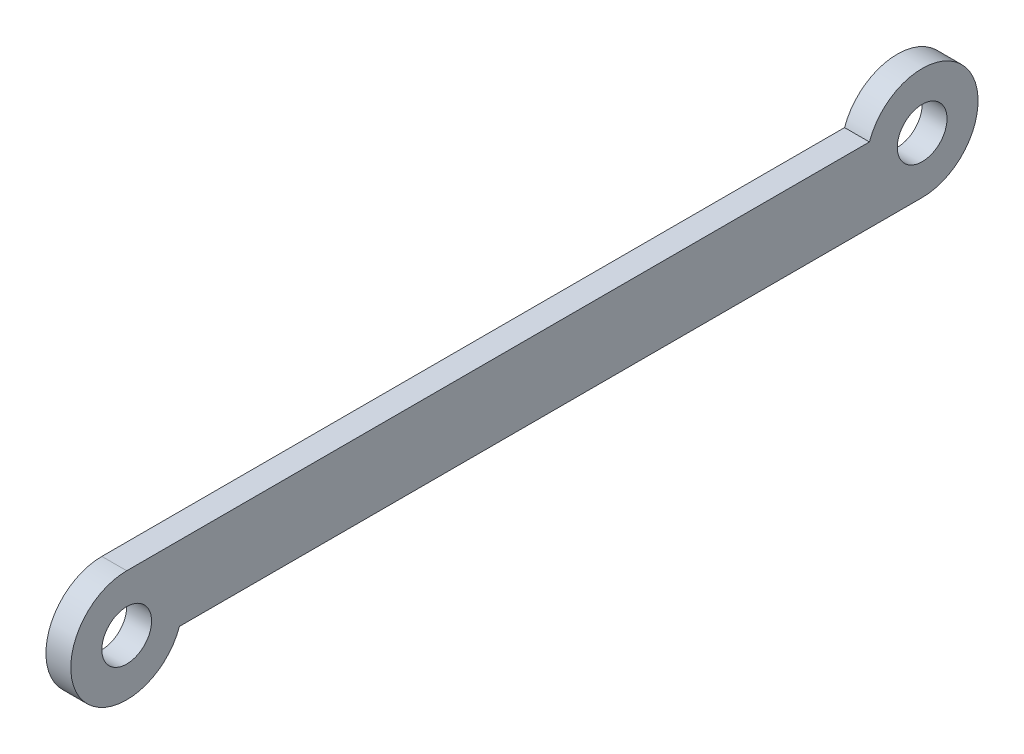
ISO-10303-21;
HEADER;
FILE_DESCRIPTION(('STEP AP214'),'2;1');
FILE_NAME('part.step','',(''),(''),'','','');
FILE_SCHEMA(('AUTOMOTIVE_DESIGN { 1 0 10303 214 1 1 1 1 }'));
ENDSEC;
DATA;
#1=APPLICATION_CONTEXT('core data for automotive mechanical design processes');
#2=APPLICATION_PROTOCOL_DEFINITION('international standard','automotive_design',2000,#1);
#3=PRODUCT_CONTEXT('',#1,'mechanical');
#4=PRODUCT('Part','Part','',(#3));
#5=PRODUCT_RELATED_PRODUCT_CATEGORY('part','',(#4));
#6=PRODUCT_DEFINITION_FORMATION('','',#4);
#7=PRODUCT_DEFINITION_CONTEXT('part definition',#1,'design');
#8=PRODUCT_DEFINITION('design','',#6,#7);
#9=PRODUCT_DEFINITION_SHAPE('','',#8);
#10=(LENGTH_UNIT() NAMED_UNIT(*) SI_UNIT(.MILLI.,.METRE.));
#11=(NAMED_UNIT(*) PLANE_ANGLE_UNIT() SI_UNIT($,.RADIAN.));
#12=(NAMED_UNIT(*) SI_UNIT($,.STERADIAN.) SOLID_ANGLE_UNIT());
#13=UNCERTAINTY_MEASURE_WITH_UNIT(LENGTH_MEASURE(1.E-05),#10,'distance_accuracy_value','');
#14=(GEOMETRIC_REPRESENTATION_CONTEXT(3) GLOBAL_UNCERTAINTY_ASSIGNED_CONTEXT((#13)) GLOBAL_UNIT_ASSIGNED_CONTEXT((#10,
#11,#12)) REPRESENTATION_CONTEXT('',''));
#15=CARTESIAN_POINT('',(0.,0.,0.));
#16=DIRECTION('',(0.,0.,1.));
#17=DIRECTION('',(1.,0.,0.));
#18=AXIS2_PLACEMENT_3D('',#15,#16,#17);
#19=CARTESIAN_POINT('',(0.,0.,0.));
#20=DIRECTION('',(1.,0.,0.));
#21=DIRECTION('',(0.,0.,-1.));
#22=AXIS2_PLACEMENT_3D('',#19,#20,#21);
#23=PLANE('',#22);
#24=CARTESIAN_POINT('',(0.,1.5,-32.));
#25=DIRECTION('',(1.,0.,0.));
#26=DIRECTION('',(0.,0.,-1.));
#27=AXIS2_PLACEMENT_3D('',#24,#25,#26);
#28=CIRCLE('',#27,2.25);
#29=CARTESIAN_POINT('',(0.,2.25,-29.8786796564404));
#30=VERTEX_POINT('',#29);
#31=CARTESIAN_POINT('',(0.,-0.750000000000001,-32.));
#32=VERTEX_POINT('',#31);
#33=EDGE_CURVE('E58',#30,#32,#28,.F.);
#34=ORIENTED_EDGE('',*,*,#33,.F.);
#35=DIRECTION('',(0.,0.,1.));
#36=VECTOR('',#35,1.);
#37=CARTESIAN_POINT('',(0.,2.25,0.));
#38=LINE('',#37,#36);
#39=CARTESIAN_POINT('',(0.,2.25,0.));
#40=VERTEX_POINT('',#39);
#41=EDGE_CURVE('E53',#40,#30,#38,.F.);
#42=ORIENTED_EDGE('',*,*,#41,.F.);
#43=CARTESIAN_POINT('',(0.,0.,0.));
#44=DIRECTION('',(1.,0.,0.));
#45=DIRECTION('',(0.,0.,-1.));
#46=AXIS2_PLACEMENT_3D('',#43,#44,#45);
#47=CIRCLE('',#46,2.25);
#48=CARTESIAN_POINT('',(0.,-0.750000000000004,-2.12132034355964));
#49=VERTEX_POINT('',#48);
#50=EDGE_CURVE('E70',#49,#40,#47,.F.);
#51=ORIENTED_EDGE('',*,*,#50,.F.);
#52=DIRECTION('',(0.,0.,-1.));
#53=VECTOR('',#52,1.);
#54=CARTESIAN_POINT('',(0.,-0.75,-32.));
#55=LINE('',#54,#53);
#56=EDGE_CURVE('E68',#32,#49,#55,.F.);
#57=ORIENTED_EDGE('',*,*,#56,.F.);
#58=EDGE_LOOP('',(#34,#42,#51,#57));
#59=FACE_BOUND('',#58,.T.);
#60=CARTESIAN_POINT('',(0.,0.,0.));
#61=DIRECTION('',(1.,0.,0.));
#62=DIRECTION('',(0.,0.,-1.));
#63=AXIS2_PLACEMENT_3D('',#60,#61,#62);
#64=CIRCLE('',#63,1.);
#65=CARTESIAN_POINT('',(0.,0.,-1.));
#66=VERTEX_POINT('',#65);
#67=EDGE_CURVE('E74',#66,#66,#64,.F.);
#68=ORIENTED_EDGE('',*,*,#67,.T.);
#69=EDGE_LOOP('',(#68));
#70=FACE_BOUND('',#69,.T.);
#71=CARTESIAN_POINT('',(0.,1.5,-32.));
#72=DIRECTION('',(1.,0.,0.));
#73=DIRECTION('',(0.,0.,-1.));
#74=AXIS2_PLACEMENT_3D('',#71,#72,#73);
#75=CIRCLE('',#74,1.);
#76=CARTESIAN_POINT('',(0.,1.5,-33.));
#77=VERTEX_POINT('',#76);
#78=EDGE_CURVE('E19',#77,#77,#75,.F.);
#79=ORIENTED_EDGE('',*,*,#78,.T.);
#80=EDGE_LOOP('',(#79));
#81=FACE_BOUND('',#80,.T.);
#82=ADVANCED_FACE('F16',(#59,#70,#81),#23,.T.);
#83=CARTESIAN_POINT('',(-1.,1.5,-32.));
#84=DIRECTION('',(1.,0.,0.));
#85=DIRECTION('',(0.,0.,-1.));
#86=AXIS2_PLACEMENT_3D('',#83,#84,#85);
#87=CYLINDRICAL_SURFACE('',#86,1.);
#88=CARTESIAN_POINT('',(-1.,1.5,-32.));
#89=DIRECTION('',(1.,0.,0.));
#90=DIRECTION('',(0.,0.,-1.));
#91=AXIS2_PLACEMENT_3D('',#88,#89,#90);
#92=CIRCLE('',#91,1.);
#93=CARTESIAN_POINT('',(-1.,1.5,-33.));
#94=VERTEX_POINT('',#93);
#95=EDGE_CURVE('E89',#94,#94,#92,.F.);
#96=ORIENTED_EDGE('',*,*,#95,.T.);
#97=EDGE_LOOP('',(#96));
#98=FACE_BOUND('',#97,.T.);
#99=ORIENTED_EDGE('',*,*,#78,.F.);
#100=EDGE_LOOP('',(#99));
#101=FACE_BOUND('',#100,.T.);
#102=ADVANCED_FACE('F99',(#98,#101),#87,.F.);
#103=CARTESIAN_POINT('',(-1.,0.,0.));
#104=DIRECTION('',(1.,0.,0.));
#105=DIRECTION('',(0.,0.,-1.));
#106=AXIS2_PLACEMENT_3D('',#103,#104,#105);
#107=CYLINDRICAL_SURFACE('',#106,1.);
#108=CARTESIAN_POINT('',(-1.,0.,0.));
#109=DIRECTION('',(1.,0.,0.));
#110=DIRECTION('',(0.,0.,-1.));
#111=AXIS2_PLACEMENT_3D('',#108,#109,#110);
#112=CIRCLE('',#111,1.);
#113=CARTESIAN_POINT('',(-1.,0.,-1.));
#114=VERTEX_POINT('',#113);
#115=EDGE_CURVE('E86',#114,#114,#112,.F.);
#116=ORIENTED_EDGE('',*,*,#115,.T.);
#117=EDGE_LOOP('',(#116));
#118=FACE_BOUND('',#117,.T.);
#119=ORIENTED_EDGE('',*,*,#67,.F.);
#120=EDGE_LOOP('',(#119));
#121=FACE_BOUND('',#120,.T.);
#122=ADVANCED_FACE('F101',(#118,#121),#107,.F.);
#123=CARTESIAN_POINT('',(-1.,-0.75,-32.));
#124=DIRECTION('',(0.,-1.,0.));
#125=DIRECTION('',(0.,0.,-1.));
#126=AXIS2_PLACEMENT_3D('',#123,#124,#125);
#127=PLANE('',#126);
#128=DIRECTION('',(0.,0.,-1.));
#129=VECTOR('',#128,1.);
#130=CARTESIAN_POINT('',(-1.,-0.750000000000004,0.));
#131=LINE('',#130,#129);
#132=CARTESIAN_POINT('',(-1.,-0.750000000000004,-2.12132034355964));
#133=VERTEX_POINT('',#132);
#134=CARTESIAN_POINT('',(-1.,-0.750000000000003,-32.));
#135=VERTEX_POINT('',#134);
#136=EDGE_CURVE('E78',#133,#135,#131,.T.);
#137=ORIENTED_EDGE('',*,*,#136,.T.);
#138=DIRECTION('',(1.,0.,0.));
#139=VECTOR('',#138,1.);
#140=CARTESIAN_POINT('',(-1.,-0.750000000000002,-32.));
#141=LINE('',#140,#139);
#142=EDGE_CURVE('E62',#32,#135,#141,.F.);
#143=ORIENTED_EDGE('',*,*,#142,.F.);
#144=ORIENTED_EDGE('',*,*,#56,.T.);
#145=DIRECTION('',(1.,0.,0.));
#146=VECTOR('',#145,1.);
#147=CARTESIAN_POINT('',(-1.,-0.750000000000004,-2.12132034355964));
#148=LINE('',#147,#146);
#149=EDGE_CURVE('E92',#133,#49,#148,.T.);
#150=ORIENTED_EDGE('',*,*,#149,.F.);
#151=EDGE_LOOP('',(#137,#143,#144,#150));
#152=FACE_BOUND('',#151,.T.);
#153=ADVANCED_FACE('F77',(#152),#127,.T.);
#154=CARTESIAN_POINT('',(-1.,1.5,-32.));
#155=DIRECTION('',(1.,0.,0.));
#156=DIRECTION('',(0.,0.,-1.));
#157=AXIS2_PLACEMENT_3D('',#154,#155,#156);
#158=CYLINDRICAL_SURFACE('',#157,2.25);
#159=DIRECTION('',(1.,0.,0.));
#160=VECTOR('',#159,1.);
#161=CARTESIAN_POINT('',(-1.,2.25,-29.8786796564404));
#162=LINE('',#161,#160);
#163=CARTESIAN_POINT('',(-1.,2.25,-29.8786796564404));
#164=VERTEX_POINT('',#163);
#165=EDGE_CURVE('E64',#30,#164,#162,.F.);
#166=ORIENTED_EDGE('',*,*,#165,.F.);
#167=ORIENTED_EDGE('',*,*,#33,.T.);
#168=ORIENTED_EDGE('',*,*,#142,.T.);
#169=CARTESIAN_POINT('',(-1.,1.5,-32.));
#170=DIRECTION('',(1.,0.,0.));
#171=DIRECTION('',(0.,0.,-1.));
#172=AXIS2_PLACEMENT_3D('',#169,#170,#171);
#173=CIRCLE('',#172,2.25);
#174=EDGE_CURVE('E84',#135,#164,#173,.T.);
#175=ORIENTED_EDGE('',*,*,#174,.T.);
#176=EDGE_LOOP('',(#166,#167,#168,#175));
#177=FACE_BOUND('',#176,.T.);
#178=ADVANCED_FACE('F60',(#177),#158,.T.);
#179=CARTESIAN_POINT('',(-1.,2.25,0.));
#180=DIRECTION('',(0.,1.,0.));
#181=DIRECTION('',(0.,0.,1.));
#182=AXIS2_PLACEMENT_3D('',#179,#180,#181);
#183=PLANE('',#182);
#184=DIRECTION('',(0.,0.,-1.));
#185=VECTOR('',#184,1.);
#186=CARTESIAN_POINT('',(-1.,2.25,0.));
#187=LINE('',#186,#185);
#188=CARTESIAN_POINT('',(-1.,2.25,0.));
#189=VERTEX_POINT('',#188);
#190=EDGE_CURVE('E25',#164,#189,#187,.F.);
#191=ORIENTED_EDGE('',*,*,#190,.T.);
#192=DIRECTION('',(1.,0.,0.));
#193=VECTOR('',#192,1.);
#194=CARTESIAN_POINT('',(-1.,2.25,0.));
#195=LINE('',#194,#193);
#196=EDGE_CURVE('E33',#40,#189,#195,.F.);
#197=ORIENTED_EDGE('',*,*,#196,.F.);
#198=ORIENTED_EDGE('',*,*,#41,.T.);
#199=ORIENTED_EDGE('',*,*,#165,.T.);
#200=EDGE_LOOP('',(#191,#197,#198,#199));
#201=FACE_BOUND('',#200,.T.);
#202=ADVANCED_FACE('F119',(#201),#183,.T.);
#203=CARTESIAN_POINT('',(-1.,0.,0.));
#204=DIRECTION('',(1.,0.,0.));
#205=DIRECTION('',(0.,0.,-1.));
#206=AXIS2_PLACEMENT_3D('',#203,#204,#205);
#207=CYLINDRICAL_SURFACE('',#206,2.25);
#208=CARTESIAN_POINT('',(-1.,0.,0.));
#209=DIRECTION('',(1.,0.,0.));
#210=DIRECTION('',(0.,0.,-1.));
#211=AXIS2_PLACEMENT_3D('',#208,#209,#210);
#212=CIRCLE('',#211,2.25);
#213=EDGE_CURVE('E11',#189,#133,#212,.T.);
#214=ORIENTED_EDGE('',*,*,#213,.T.);
#215=ORIENTED_EDGE('',*,*,#149,.T.);
#216=ORIENTED_EDGE('',*,*,#50,.T.);
#217=ORIENTED_EDGE('',*,*,#196,.T.);
#218=EDGE_LOOP('',(#214,#215,#216,#217));
#219=FACE_BOUND('',#218,.T.);
#220=ADVANCED_FACE('F113',(#219),#207,.T.);
#221=CARTESIAN_POINT('',(-1.,0.,0.));
#222=DIRECTION('',(1.,0.,0.));
#223=DIRECTION('',(0.,0.,-1.));
#224=AXIS2_PLACEMENT_3D('',#221,#222,#223);
#225=PLANE('',#224);
#226=ORIENTED_EDGE('',*,*,#190,.F.);
#227=ORIENTED_EDGE('',*,*,#174,.F.);
#228=ORIENTED_EDGE('',*,*,#136,.F.);
#229=ORIENTED_EDGE('',*,*,#213,.F.);
#230=EDGE_LOOP('',(#226,#227,#228,#229));
#231=FACE_BOUND('',#230,.T.);
#232=ORIENTED_EDGE('',*,*,#115,.F.);
#233=EDGE_LOOP('',(#232));
#234=FACE_BOUND('',#233,.T.);
#235=ORIENTED_EDGE('',*,*,#95,.F.);
#236=EDGE_LOOP('',(#235));
#237=FACE_BOUND('',#236,.T.);
#238=ADVANCED_FACE('F111',(#231,#234,#237),#225,.F.);
#239=CLOSED_SHELL('',(#82,#102,#122,#153,#178,#202,#220,#238));
#240=MANIFOLD_SOLID_BREP('B1',#239);
#241=ADVANCED_BREP_SHAPE_REPRESENTATION('',(#18,#240),#14);
#242=SHAPE_DEFINITION_REPRESENTATION(#9,#241);
ENDSEC;
END-ISO-10303-21;
